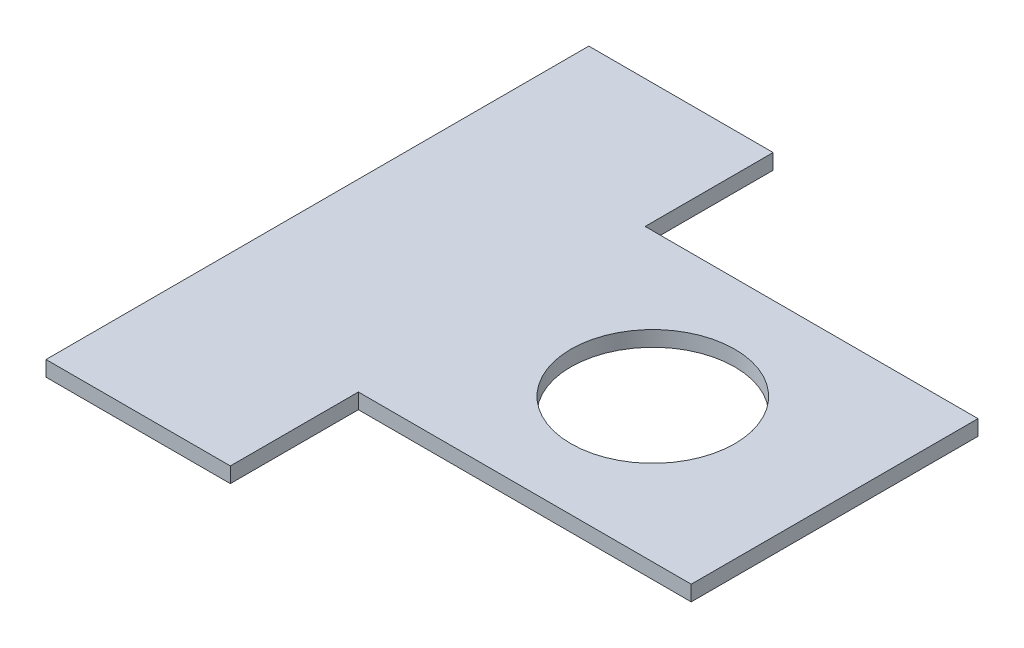
ISO-10303-21;
HEADER;
FILE_DESCRIPTION(('STEP AP214'),'2;1');
FILE_NAME('part.step','',(''),(''),'','','');
FILE_SCHEMA(('AUTOMOTIVE_DESIGN { 1 0 10303 214 1 1 1 1 }'));
ENDSEC;
DATA;
#1=APPLICATION_CONTEXT('core data for automotive mechanical design processes');
#2=APPLICATION_PROTOCOL_DEFINITION('international standard','automotive_design',2000,#1);
#3=PRODUCT_CONTEXT('',#1,'mechanical');
#4=PRODUCT('Part','Part','',(#3));
#5=PRODUCT_RELATED_PRODUCT_CATEGORY('part','',(#4));
#6=PRODUCT_DEFINITION_FORMATION('','',#4);
#7=PRODUCT_DEFINITION_CONTEXT('part definition',#1,'design');
#8=PRODUCT_DEFINITION('design','',#6,#7);
#9=PRODUCT_DEFINITION_SHAPE('','',#8);
#10=(LENGTH_UNIT() NAMED_UNIT(*) SI_UNIT(.MILLI.,.METRE.));
#11=(NAMED_UNIT(*) PLANE_ANGLE_UNIT() SI_UNIT($,.RADIAN.));
#12=(NAMED_UNIT(*) SI_UNIT($,.STERADIAN.) SOLID_ANGLE_UNIT());
#13=UNCERTAINTY_MEASURE_WITH_UNIT(LENGTH_MEASURE(1.E-05),#10,'distance_accuracy_value','');
#14=(GEOMETRIC_REPRESENTATION_CONTEXT(3) GLOBAL_UNCERTAINTY_ASSIGNED_CONTEXT((#13)) GLOBAL_UNIT_ASSIGNED_CONTEXT((#10,
#11,#12)) REPRESENTATION_CONTEXT('',''));
#15=CARTESIAN_POINT('',(0.,0.,0.));
#16=DIRECTION('',(0.,0.,1.));
#17=DIRECTION('',(1.,0.,0.));
#18=AXIS2_PLACEMENT_3D('',#15,#16,#17);
#19=CARTESIAN_POINT('',(101.,3.,0.));
#20=DIRECTION('',(1.,0.,0.));
#21=DIRECTION('',(0.,0.,-1.));
#22=AXIS2_PLACEMENT_3D('',#19,#20,#21);
#23=PLANE('',#22);
#24=DIRECTION('',(0.,0.,1.));
#25=VECTOR('',#24,1.);
#26=CARTESIAN_POINT('',(101.,0.,0.));
#27=LINE('',#26,#25);
#28=CARTESIAN_POINT('',(101.,0.,-28.));
#29=VERTEX_POINT('',#28);
#30=CARTESIAN_POINT('',(101.,0.,28.));
#31=VERTEX_POINT('',#30);
#32=EDGE_CURVE('E171',#29,#31,#27,.T.);
#33=ORIENTED_EDGE('',*,*,#32,.F.);
#34=DIRECTION('',(0.,-1.,0.));
#35=VECTOR('',#34,1.);
#36=CARTESIAN_POINT('',(101.,3.,-28.));
#37=LINE('',#36,#35);
#38=CARTESIAN_POINT('',(101.,3.,-28.));
#39=VERTEX_POINT('',#38);
#40=EDGE_CURVE('E11',#39,#29,#37,.T.);
#41=ORIENTED_EDGE('',*,*,#40,.F.);
#42=DIRECTION('',(0.,0.,1.));
#43=VECTOR('',#42,1.);
#44=CARTESIAN_POINT('',(101.,3.,0.));
#45=LINE('',#44,#43);
#46=CARTESIAN_POINT('',(101.,3.,28.));
#47=VERTEX_POINT('',#46);
#48=EDGE_CURVE('E236',#39,#47,#45,.T.);
#49=ORIENTED_EDGE('',*,*,#48,.T.);
#50=DIRECTION('',(0.,-1.,0.));
#51=VECTOR('',#50,1.);
#52=CARTESIAN_POINT('',(101.,3.,28.));
#53=LINE('',#52,#51);
#54=EDGE_CURVE('E97',#47,#31,#53,.T.);
#55=ORIENTED_EDGE('',*,*,#54,.T.);
#56=EDGE_LOOP('',(#33,#41,#49,#55));
#57=FACE_BOUND('',#56,.T.);
#58=ADVANCED_FACE('F45',(#57),#23,.T.);
#59=CARTESIAN_POINT('',(0.,3.,-28.));
#60=DIRECTION('',(0.,0.,-1.));
#61=DIRECTION('',(-1.,0.,0.));
#62=AXIS2_PLACEMENT_3D('',#59,#60,#61);
#63=PLANE('',#62);
#64=DIRECTION('',(1.,0.,0.));
#65=VECTOR('',#64,1.);
#66=CARTESIAN_POINT('',(0.,0.,-28.));
#67=LINE('',#66,#65);
#68=CARTESIAN_POINT('',(36.,0.,-28.));
#69=VERTEX_POINT('',#68);
#70=EDGE_CURVE('E168',#69,#29,#67,.T.);
#71=ORIENTED_EDGE('',*,*,#70,.F.);
#72=DIRECTION('',(0.,-1.,0.));
#73=VECTOR('',#72,1.);
#74=CARTESIAN_POINT('',(36.,3.,-28.));
#75=LINE('',#74,#73);
#76=CARTESIAN_POINT('',(36.,3.,-28.));
#77=VERTEX_POINT('',#76);
#78=EDGE_CURVE('E55',#77,#69,#75,.T.);
#79=ORIENTED_EDGE('',*,*,#78,.F.);
#80=DIRECTION('',(1.,0.,0.));
#81=VECTOR('',#80,1.);
#82=CARTESIAN_POINT('',(0.,3.,-28.));
#83=LINE('',#82,#81);
#84=EDGE_CURVE('E239',#77,#39,#83,.T.);
#85=ORIENTED_EDGE('',*,*,#84,.T.);
#86=ORIENTED_EDGE('',*,*,#40,.T.);
#87=EDGE_LOOP('',(#71,#79,#85,#86));
#88=FACE_BOUND('',#87,.T.);
#89=ADVANCED_FACE('F169',(#88),#63,.T.);
#90=CARTESIAN_POINT('',(36.,3.,0.));
#91=DIRECTION('',(1.,0.,0.));
#92=DIRECTION('',(0.,0.,-1.));
#93=AXIS2_PLACEMENT_3D('',#90,#91,#92);
#94=PLANE('',#93);
#95=DIRECTION('',(0.,0.,1.));
#96=VECTOR('',#95,1.);
#97=CARTESIAN_POINT('',(36.,0.,0.));
#98=LINE('',#97,#96);
#99=CARTESIAN_POINT('',(36.,0.,-53.));
#100=VERTEX_POINT('',#99);
#101=EDGE_CURVE('E160',#100,#69,#98,.T.);
#102=ORIENTED_EDGE('',*,*,#101,.F.);
#103=DIRECTION('',(0.,-1.,0.));
#104=VECTOR('',#103,1.);
#105=CARTESIAN_POINT('',(36.,3.,-53.));
#106=LINE('',#105,#104);
#107=CARTESIAN_POINT('',(36.,3.,-53.));
#108=VERTEX_POINT('',#107);
#109=EDGE_CURVE('E151',#108,#100,#106,.T.);
#110=ORIENTED_EDGE('',*,*,#109,.F.);
#111=DIRECTION('',(0.,0.,1.));
#112=VECTOR('',#111,1.);
#113=CARTESIAN_POINT('',(36.,3.,0.));
#114=LINE('',#113,#112);
#115=EDGE_CURVE('E163',#108,#77,#114,.T.);
#116=ORIENTED_EDGE('',*,*,#115,.T.);
#117=ORIENTED_EDGE('',*,*,#78,.T.);
#118=EDGE_LOOP('',(#102,#110,#116,#117));
#119=FACE_BOUND('',#118,.T.);
#120=ADVANCED_FACE('F158',(#119),#94,.T.);
#121=CARTESIAN_POINT('',(0.,3.,-53.));
#122=DIRECTION('',(0.,0.,-1.));
#123=DIRECTION('',(-1.,0.,0.));
#124=AXIS2_PLACEMENT_3D('',#121,#122,#123);
#125=PLANE('',#124);
#126=DIRECTION('',(1.,0.,0.));
#127=VECTOR('',#126,1.);
#128=CARTESIAN_POINT('',(0.,0.,-53.));
#129=LINE('',#128,#127);
#130=CARTESIAN_POINT('',(0.,0.,-53.));
#131=VERTEX_POINT('',#130);
#132=EDGE_CURVE('E176',#131,#100,#129,.T.);
#133=ORIENTED_EDGE('',*,*,#132,.F.);
#134=DIRECTION('',(0.,-1.,0.));
#135=VECTOR('',#134,1.);
#136=CARTESIAN_POINT('',(0.,3.,-53.));
#137=LINE('',#136,#135);
#138=CARTESIAN_POINT('',(0.,3.,-53.));
#139=VERTEX_POINT('',#138);
#140=EDGE_CURVE('E144',#139,#131,#137,.T.);
#141=ORIENTED_EDGE('',*,*,#140,.F.);
#142=DIRECTION('',(1.,0.,0.));
#143=VECTOR('',#142,1.);
#144=CARTESIAN_POINT('',(0.,3.,-53.));
#145=LINE('',#144,#143);
#146=EDGE_CURVE('E246',#139,#108,#145,.T.);
#147=ORIENTED_EDGE('',*,*,#146,.T.);
#148=ORIENTED_EDGE('',*,*,#109,.T.);
#149=EDGE_LOOP('',(#133,#141,#147,#148));
#150=FACE_BOUND('',#149,.T.);
#151=ADVANCED_FACE('F209',(#150),#125,.T.);
#152=CARTESIAN_POINT('',(0.,3.,0.));
#153=DIRECTION('',(-1.,0.,0.));
#154=DIRECTION('',(0.,0.,1.));
#155=AXIS2_PLACEMENT_3D('',#152,#153,#154);
#156=PLANE('',#155);
#157=DIRECTION('',(0.,0.,-1.));
#158=VECTOR('',#157,1.);
#159=CARTESIAN_POINT('',(0.,0.,0.));
#160=LINE('',#159,#158);
#161=CARTESIAN_POINT('',(0.,0.,53.));
#162=VERTEX_POINT('',#161);
#163=EDGE_CURVE('E180',#162,#131,#160,.T.);
#164=ORIENTED_EDGE('',*,*,#163,.F.);
#165=DIRECTION('',(0.,-1.,0.));
#166=VECTOR('',#165,1.);
#167=CARTESIAN_POINT('',(0.,3.,53.));
#168=LINE('',#167,#166);
#169=CARTESIAN_POINT('',(0.,3.,53.));
#170=VERTEX_POINT('',#169);
#171=EDGE_CURVE('E140',#170,#162,#168,.T.);
#172=ORIENTED_EDGE('',*,*,#171,.F.);
#173=DIRECTION('',(0.,0.,-1.));
#174=VECTOR('',#173,1.);
#175=CARTESIAN_POINT('',(0.,3.,0.));
#176=LINE('',#175,#174);
#177=EDGE_CURVE('E132',#170,#139,#176,.T.);
#178=ORIENTED_EDGE('',*,*,#177,.T.);
#179=ORIENTED_EDGE('',*,*,#140,.T.);
#180=EDGE_LOOP('',(#164,#172,#178,#179));
#181=FACE_BOUND('',#180,.T.);
#182=ADVANCED_FACE('F212',(#181),#156,.T.);
#183=CARTESIAN_POINT('',(0.,3.,53.));
#184=DIRECTION('',(0.,0.,-1.));
#185=DIRECTION('',(-1.,0.,0.));
#186=AXIS2_PLACEMENT_3D('',#183,#184,#185);
#187=PLANE('',#186);
#188=DIRECTION('',(1.,0.,0.));
#189=VECTOR('',#188,1.);
#190=CARTESIAN_POINT('',(0.,0.,53.));
#191=LINE('',#190,#189);
#192=CARTESIAN_POINT('',(36.,0.,53.));
#193=VERTEX_POINT('',#192);
#194=EDGE_CURVE('E138',#162,#193,#191,.T.);
#195=ORIENTED_EDGE('',*,*,#194,.T.);
#196=DIRECTION('',(0.,-1.,0.));
#197=VECTOR('',#196,1.);
#198=CARTESIAN_POINT('',(36.,3.,53.));
#199=LINE('',#198,#197);
#200=CARTESIAN_POINT('',(36.,3.,53.));
#201=VERTEX_POINT('',#200);
#202=EDGE_CURVE('E121',#201,#193,#199,.T.);
#203=ORIENTED_EDGE('',*,*,#202,.F.);
#204=DIRECTION('',(1.,0.,0.));
#205=VECTOR('',#204,1.);
#206=CARTESIAN_POINT('',(0.,3.,53.));
#207=LINE('',#206,#205);
#208=EDGE_CURVE('E125',#170,#201,#207,.T.);
#209=ORIENTED_EDGE('',*,*,#208,.F.);
#210=ORIENTED_EDGE('',*,*,#171,.T.);
#211=EDGE_LOOP('',(#195,#203,#209,#210));
#212=FACE_BOUND('',#211,.T.);
#213=ADVANCED_FACE('F136',(#212),#187,.F.);
#214=CARTESIAN_POINT('',(36.,3.,0.));
#215=DIRECTION('',(-1.,0.,0.));
#216=DIRECTION('',(0.,0.,1.));
#217=AXIS2_PLACEMENT_3D('',#214,#215,#216);
#218=PLANE('',#217);
#219=DIRECTION('',(0.,0.,-1.));
#220=VECTOR('',#219,1.);
#221=CARTESIAN_POINT('',(36.,0.,0.));
#222=LINE('',#221,#220);
#223=CARTESIAN_POINT('',(36.,0.,28.));
#224=VERTEX_POINT('',#223);
#225=EDGE_CURVE('E188',#193,#224,#222,.T.);
#226=ORIENTED_EDGE('',*,*,#225,.T.);
#227=DIRECTION('',(0.,-1.,0.));
#228=VECTOR('',#227,1.);
#229=CARTESIAN_POINT('',(36.,3.,28.));
#230=LINE('',#229,#228);
#231=CARTESIAN_POINT('',(36.,3.,28.));
#232=VERTEX_POINT('',#231);
#233=EDGE_CURVE('E123',#232,#224,#230,.T.);
#234=ORIENTED_EDGE('',*,*,#233,.F.);
#235=DIRECTION('',(0.,0.,-1.));
#236=VECTOR('',#235,1.);
#237=CARTESIAN_POINT('',(36.,3.,0.));
#238=LINE('',#237,#236);
#239=EDGE_CURVE('E116',#201,#232,#238,.T.);
#240=ORIENTED_EDGE('',*,*,#239,.F.);
#241=ORIENTED_EDGE('',*,*,#202,.T.);
#242=EDGE_LOOP('',(#226,#234,#240,#241));
#243=FACE_BOUND('',#242,.T.);
#244=ADVANCED_FACE('F119',(#243),#218,.F.);
#245=CARTESIAN_POINT('',(65.5,3.,0.));
#246=DIRECTION('',(0.,-1.,0.));
#247=DIRECTION('',(0.,0.,-1.));
#248=AXIS2_PLACEMENT_3D('',#245,#246,#247);
#249=CYLINDRICAL_SURFACE('',#248,16.);
#250=CARTESIAN_POINT('',(65.5,3.,0.));
#251=DIRECTION('',(0.,1.,0.));
#252=DIRECTION('',(0.,0.,1.));
#253=AXIS2_PLACEMENT_3D('',#250,#251,#252);
#254=CIRCLE('',#253,16.);
#255=CARTESIAN_POINT('',(65.5,3.,16.));
#256=VERTEX_POINT('',#255);
#257=EDGE_CURVE('E192',#256,#256,#254,.T.);
#258=ORIENTED_EDGE('',*,*,#257,.T.);
#259=EDGE_LOOP('',(#258));
#260=FACE_BOUND('',#259,.T.);
#261=CARTESIAN_POINT('',(65.5,0.,0.));
#262=DIRECTION('',(0.,1.,0.));
#263=DIRECTION('',(0.,0.,1.));
#264=AXIS2_PLACEMENT_3D('',#261,#262,#263);
#265=CIRCLE('',#264,16.);
#266=CARTESIAN_POINT('',(65.5,0.,16.));
#267=VERTEX_POINT('',#266);
#268=EDGE_CURVE('E197',#267,#267,#265,.T.);
#269=ORIENTED_EDGE('',*,*,#268,.F.);
#270=EDGE_LOOP('',(#269));
#271=FACE_BOUND('',#270,.T.);
#272=ADVANCED_FACE('F47',(#260,#271),#249,.F.);
#273=CARTESIAN_POINT('',(0.,3.,28.));
#274=DIRECTION('',(0.,0.,-1.));
#275=DIRECTION('',(-1.,0.,0.));
#276=AXIS2_PLACEMENT_3D('',#273,#274,#275);
#277=PLANE('',#276);
#278=DIRECTION('',(1.,0.,0.));
#279=VECTOR('',#278,1.);
#280=CARTESIAN_POINT('',(0.,0.,28.));
#281=LINE('',#280,#279);
#282=EDGE_CURVE('E90',#224,#31,#281,.T.);
#283=ORIENTED_EDGE('',*,*,#282,.T.);
#284=ORIENTED_EDGE('',*,*,#54,.F.);
#285=DIRECTION('',(1.,0.,0.));
#286=VECTOR('',#285,1.);
#287=CARTESIAN_POINT('',(0.,3.,28.));
#288=LINE('',#287,#286);
#289=EDGE_CURVE('E63',#232,#47,#288,.T.);
#290=ORIENTED_EDGE('',*,*,#289,.F.);
#291=ORIENTED_EDGE('',*,*,#233,.T.);
#292=EDGE_LOOP('',(#283,#284,#290,#291));
#293=FACE_BOUND('',#292,.T.);
#294=ADVANCED_FACE('F221',(#293),#277,.F.);
#295=CARTESIAN_POINT('',(0.,3.,0.));
#296=DIRECTION('',(0.,1.,0.));
#297=DIRECTION('',(0.,0.,1.));
#298=AXIS2_PLACEMENT_3D('',#295,#296,#297);
#299=PLANE('',#298);
#300=ORIENTED_EDGE('',*,*,#257,.F.);
#301=EDGE_LOOP('',(#300));
#302=FACE_BOUND('',#301,.T.);
#303=ORIENTED_EDGE('',*,*,#48,.F.);
#304=ORIENTED_EDGE('',*,*,#84,.F.);
#305=ORIENTED_EDGE('',*,*,#115,.F.);
#306=ORIENTED_EDGE('',*,*,#146,.F.);
#307=ORIENTED_EDGE('',*,*,#177,.F.);
#308=ORIENTED_EDGE('',*,*,#208,.T.);
#309=ORIENTED_EDGE('',*,*,#239,.T.);
#310=ORIENTED_EDGE('',*,*,#289,.T.);
#311=EDGE_LOOP('',(#303,#304,#305,#306,#307,#308,#309,#310));
#312=FACE_BOUND('',#311,.T.);
#313=ADVANCED_FACE('F129',(#302,#312),#299,.T.);
#314=CARTESIAN_POINT('',(0.,0.,0.));
#315=DIRECTION('',(0.,1.,0.));
#316=DIRECTION('',(0.,0.,1.));
#317=AXIS2_PLACEMENT_3D('',#314,#315,#316);
#318=PLANE('',#317);
#319=ORIENTED_EDGE('',*,*,#268,.T.);
#320=EDGE_LOOP('',(#319));
#321=FACE_BOUND('',#320,.T.);
#322=ORIENTED_EDGE('',*,*,#32,.T.);
#323=ORIENTED_EDGE('',*,*,#282,.F.);
#324=ORIENTED_EDGE('',*,*,#225,.F.);
#325=ORIENTED_EDGE('',*,*,#194,.F.);
#326=ORIENTED_EDGE('',*,*,#163,.T.);
#327=ORIENTED_EDGE('',*,*,#132,.T.);
#328=ORIENTED_EDGE('',*,*,#101,.T.);
#329=ORIENTED_EDGE('',*,*,#70,.T.);
#330=EDGE_LOOP('',(#322,#323,#324,#325,#326,#327,#328,#329));
#331=FACE_BOUND('',#330,.T.);
#332=ADVANCED_FACE('F173',(#321,#331),#318,.F.);
#333=CLOSED_SHELL('',(#58,#89,#120,#151,#182,#213,#244,#272,#294,#313,#332));
#334=MANIFOLD_SOLID_BREP('B2',#333);
#335=ADVANCED_BREP_SHAPE_REPRESENTATION('',(#18,#334),#14);
#336=SHAPE_DEFINITION_REPRESENTATION(#9,#335);
ENDSEC;
END-ISO-10303-21;
